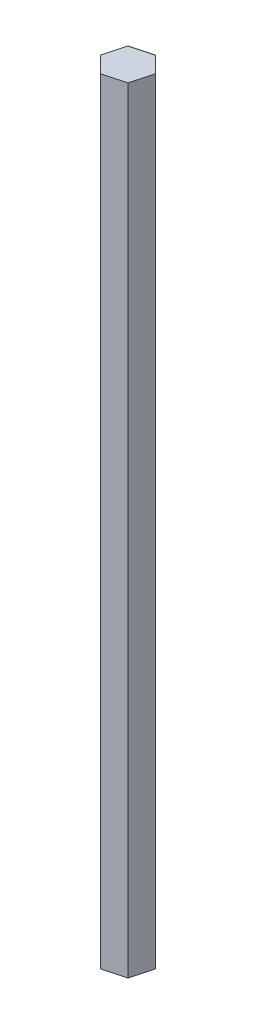
ISO-10303-21;
HEADER;
FILE_DESCRIPTION(('STEP AP214'),'2;1');
FILE_NAME('part.step','',(''),(''),'','','');
FILE_SCHEMA(('AUTOMOTIVE_DESIGN { 1 0 10303 214 1 1 1 1 }'));
ENDSEC;
DATA;
#1=APPLICATION_CONTEXT('core data for automotive mechanical design processes');
#2=APPLICATION_PROTOCOL_DEFINITION('international standard','automotive_design',2000,#1);
#3=PRODUCT_CONTEXT('',#1,'mechanical');
#4=PRODUCT('Part','Part','',(#3));
#5=PRODUCT_RELATED_PRODUCT_CATEGORY('part','',(#4));
#6=PRODUCT_DEFINITION_FORMATION('','',#4);
#7=PRODUCT_DEFINITION_CONTEXT('part definition',#1,'design');
#8=PRODUCT_DEFINITION('design','',#6,#7);
#9=PRODUCT_DEFINITION_SHAPE('','',#8);
#10=(LENGTH_UNIT() NAMED_UNIT(*) SI_UNIT(.MILLI.,.METRE.));
#11=(NAMED_UNIT(*) PLANE_ANGLE_UNIT() SI_UNIT($,.RADIAN.));
#12=(NAMED_UNIT(*) SI_UNIT($,.STERADIAN.) SOLID_ANGLE_UNIT());
#13=UNCERTAINTY_MEASURE_WITH_UNIT(LENGTH_MEASURE(1.E-05),#10,'distance_accuracy_value','');
#14=(GEOMETRIC_REPRESENTATION_CONTEXT(3) GLOBAL_UNCERTAINTY_ASSIGNED_CONTEXT((#13)) GLOBAL_UNIT_ASSIGNED_CONTEXT((#10,
#11,#12)) REPRESENTATION_CONTEXT('',''));
#15=CARTESIAN_POINT('',(0.,0.,0.));
#16=DIRECTION('',(0.,0.,1.));
#17=DIRECTION('',(1.,0.,0.));
#18=AXIS2_PLACEMENT_3D('',#15,#16,#17);
#19=CARTESIAN_POINT('',(-1.90646108622519,252.476,7.11500963644527));
#20=DIRECTION('',(-0.258819045102518,0.,-0.965925826289069));
#21=DIRECTION('',(-0.965925826289069,0.,0.258819045102518));
#22=AXIS2_PLACEMENT_3D('',#19,#20,#21);
#23=PLANE('',#22);
#24=DIRECTION('',(0.965925826289069,0.,-0.258819045102518));
#25=VECTOR('',#24,1.);
#26=CARTESIAN_POINT('',(-1.90646108622519,0.,7.11500963644527));
#27=LINE('',#26,#25);
#28=CARTESIAN_POINT('',(-1.90646108622519,0.,7.11500963644527));
#29=VERTEX_POINT('',#28);
#30=CARTESIAN_POINT('',(5.20854855022009,0.,5.20854855022012));
#31=VERTEX_POINT('',#30);
#32=EDGE_CURVE('E128',#29,#31,#27,.T.);
#33=ORIENTED_EDGE('',*,*,#32,.T.);
#34=DIRECTION('',(0.,-1.,0.));
#35=VECTOR('',#34,1.);
#36=CARTESIAN_POINT('',(5.20854855022009,252.476,5.20854855022012));
#37=LINE('',#36,#35);
#38=CARTESIAN_POINT('',(5.20854855022009,252.476,5.20854855022012));
#39=VERTEX_POINT('',#38);
#40=EDGE_CURVE('E11',#39,#31,#37,.T.);
#41=ORIENTED_EDGE('',*,*,#40,.F.);
#42=DIRECTION('',(0.965925826289069,0.,-0.258819045102518));
#43=VECTOR('',#42,1.);
#44=CARTESIAN_POINT('',(-1.90646108622519,252.476,7.11500963644527));
#45=LINE('',#44,#43);
#46=CARTESIAN_POINT('',(-1.90646108622519,252.476,7.11500963644527));
#47=VERTEX_POINT('',#46);
#48=EDGE_CURVE('E144',#47,#39,#45,.T.);
#49=ORIENTED_EDGE('',*,*,#48,.F.);
#50=DIRECTION('',(0.,-1.,0.));
#51=VECTOR('',#50,1.);
#52=CARTESIAN_POINT('',(-1.90646108622519,252.476,7.11500963644527));
#53=LINE('',#52,#51);
#54=EDGE_CURVE('E124',#47,#29,#53,.T.);
#55=ORIENTED_EDGE('',*,*,#54,.T.);
#56=EDGE_LOOP('',(#33,#41,#49,#55));
#57=FACE_BOUND('',#56,.T.);
#58=ADVANCED_FACE('F39',(#57),#23,.F.);
#59=CARTESIAN_POINT('',(5.20854855022009,252.476,5.20854855022012));
#60=DIRECTION('',(-0.965925826289068,0.,-0.258819045102524));
#61=DIRECTION('',(-0.258819045102524,0.,0.965925826289068));
#62=AXIS2_PLACEMENT_3D('',#59,#60,#61);
#63=PLANE('',#62);
#64=DIRECTION('',(0.258819045102524,0.,-0.965925826289068));
#65=VECTOR('',#64,1.);
#66=CARTESIAN_POINT('',(5.20854855022009,0.,5.20854855022012));
#67=LINE('',#66,#65);
#68=CARTESIAN_POINT('',(7.11500963644528,0.,-1.90646108622515));
#69=VERTEX_POINT('',#68);
#70=EDGE_CURVE('E132',#31,#69,#67,.T.);
#71=ORIENTED_EDGE('',*,*,#70,.T.);
#72=DIRECTION('',(0.,-1.,0.));
#73=VECTOR('',#72,1.);
#74=CARTESIAN_POINT('',(7.11500963644528,252.476,-1.90646108622515));
#75=LINE('',#74,#73);
#76=CARTESIAN_POINT('',(7.11500963644528,252.476,-1.90646108622515));
#77=VERTEX_POINT('',#76);
#78=EDGE_CURVE('E48',#77,#69,#75,.T.);
#79=ORIENTED_EDGE('',*,*,#78,.F.);
#80=DIRECTION('',(0.258819045102524,0.,-0.965925826289068));
#81=VECTOR('',#80,1.);
#82=CARTESIAN_POINT('',(5.20854855022009,252.476,5.20854855022012));
#83=LINE('',#82,#81);
#84=EDGE_CURVE('E93',#39,#77,#83,.T.);
#85=ORIENTED_EDGE('',*,*,#84,.F.);
#86=ORIENTED_EDGE('',*,*,#40,.T.);
#87=EDGE_LOOP('',(#71,#79,#85,#86));
#88=FACE_BOUND('',#87,.T.);
#89=ADVANCED_FACE('F172',(#88),#63,.F.);
#90=CARTESIAN_POINT('',(7.11500963644528,252.476,-1.90646108622515));
#91=DIRECTION('',(-0.70710678118655,0.,0.707106781186545));
#92=DIRECTION('',(0.707106781186545,0.,0.70710678118655));
#93=AXIS2_PLACEMENT_3D('',#90,#91,#92);
#94=PLANE('',#93);
#95=DIRECTION('',(-0.707106781186546,0.,-0.70710678118655));
#96=VECTOR('',#95,1.);
#97=CARTESIAN_POINT('',(7.11500963644528,0.,-1.90646108622515));
#98=LINE('',#97,#96);
#99=CARTESIAN_POINT('',(1.90646108622519,0.,-7.11500963644527));
#100=VERTEX_POINT('',#99);
#101=EDGE_CURVE('E135',#69,#100,#98,.T.);
#102=ORIENTED_EDGE('',*,*,#101,.T.);
#103=DIRECTION('',(0.,-1.,0.));
#104=VECTOR('',#103,1.);
#105=CARTESIAN_POINT('',(1.90646108622519,252.476,-7.11500963644527));
#106=LINE('',#105,#104);
#107=CARTESIAN_POINT('',(1.90646108622519,252.476,-7.11500963644527));
#108=VERTEX_POINT('',#107);
#109=EDGE_CURVE('E117',#108,#100,#106,.T.);
#110=ORIENTED_EDGE('',*,*,#109,.F.);
#111=DIRECTION('',(-0.707106781186546,0.,-0.70710678118655));
#112=VECTOR('',#111,1.);
#113=CARTESIAN_POINT('',(7.11500963644528,252.476,-1.90646108622515));
#114=LINE('',#113,#112);
#115=EDGE_CURVE('E106',#77,#108,#114,.T.);
#116=ORIENTED_EDGE('',*,*,#115,.F.);
#117=ORIENTED_EDGE('',*,*,#78,.T.);
#118=EDGE_LOOP('',(#102,#110,#116,#117));
#119=FACE_BOUND('',#118,.T.);
#120=ADVANCED_FACE('F154',(#119),#94,.F.);
#121=CARTESIAN_POINT('',(1.90646108622519,252.476,-7.11500963644527));
#122=DIRECTION('',(0.258819045102518,0.,0.965925826289069));
#123=DIRECTION('',(0.965925826289069,0.,-0.258819045102518));
#124=AXIS2_PLACEMENT_3D('',#121,#122,#123);
#125=PLANE('',#124);
#126=DIRECTION('',(-0.965925826289069,0.,0.258819045102518));
#127=VECTOR('',#126,1.);
#128=CARTESIAN_POINT('',(1.90646108622519,0.,-7.11500963644527));
#129=LINE('',#128,#127);
#130=CARTESIAN_POINT('',(-5.20854855022009,0.,-5.20854855022012));
#131=VERTEX_POINT('',#130);
#132=EDGE_CURVE('E115',#100,#131,#129,.T.);
#133=ORIENTED_EDGE('',*,*,#132,.T.);
#134=DIRECTION('',(0.,-1.,0.));
#135=VECTOR('',#134,1.);
#136=CARTESIAN_POINT('',(-5.20854855022009,252.476,-5.20854855022012));
#137=LINE('',#136,#135);
#138=CARTESIAN_POINT('',(-5.20854855022009,252.476,-5.20854855022012));
#139=VERTEX_POINT('',#138);
#140=EDGE_CURVE('E112',#139,#131,#137,.T.);
#141=ORIENTED_EDGE('',*,*,#140,.F.);
#142=DIRECTION('',(-0.965925826289069,0.,0.258819045102518));
#143=VECTOR('',#142,1.);
#144=CARTESIAN_POINT('',(1.90646108622519,252.476,-7.11500963644527));
#145=LINE('',#144,#143);
#146=EDGE_CURVE('E100',#108,#139,#145,.T.);
#147=ORIENTED_EDGE('',*,*,#146,.F.);
#148=ORIENTED_EDGE('',*,*,#109,.T.);
#149=EDGE_LOOP('',(#133,#141,#147,#148));
#150=FACE_BOUND('',#149,.T.);
#151=ADVANCED_FACE('F113',(#150),#125,.F.);
#152=CARTESIAN_POINT('',(-5.20854855022009,252.476,-5.20854855022012));
#153=DIRECTION('',(0.965925826289068,0.,0.258819045102524));
#154=DIRECTION('',(0.258819045102524,0.,-0.965925826289068));
#155=AXIS2_PLACEMENT_3D('',#152,#153,#154);
#156=PLANE('',#155);
#157=DIRECTION('',(-0.258819045102524,0.,0.965925826289068));
#158=VECTOR('',#157,1.);
#159=CARTESIAN_POINT('',(-5.20854855022009,0.,-5.20854855022012));
#160=LINE('',#159,#158);
#161=CARTESIAN_POINT('',(-7.11500963644528,0.,1.90646108622515));
#162=VERTEX_POINT('',#161);
#163=EDGE_CURVE('E79',#131,#162,#160,.T.);
#164=ORIENTED_EDGE('',*,*,#163,.T.);
#165=DIRECTION('',(0.,-1.,0.));
#166=VECTOR('',#165,1.);
#167=CARTESIAN_POINT('',(-7.11500963644528,252.476,1.90646108622515));
#168=LINE('',#167,#166);
#169=CARTESIAN_POINT('',(-7.11500963644528,252.476,1.90646108622515));
#170=VERTEX_POINT('',#169);
#171=EDGE_CURVE('E118',#170,#162,#168,.T.);
#172=ORIENTED_EDGE('',*,*,#171,.F.);
#173=DIRECTION('',(-0.258819045102524,0.,0.965925826289068));
#174=VECTOR('',#173,1.);
#175=CARTESIAN_POINT('',(-5.20854855022009,252.476,-5.20854855022012));
#176=LINE('',#175,#174);
#177=EDGE_CURVE('E104',#139,#170,#176,.T.);
#178=ORIENTED_EDGE('',*,*,#177,.F.);
#179=ORIENTED_EDGE('',*,*,#140,.T.);
#180=EDGE_LOOP('',(#164,#172,#178,#179));
#181=FACE_BOUND('',#180,.T.);
#182=ADVANCED_FACE('F120',(#181),#156,.F.);
#183=CARTESIAN_POINT('',(-7.11500963644528,252.476,1.90646108622515));
#184=DIRECTION('',(0.707106781186549,0.,-0.707106781186545));
#185=DIRECTION('',(-0.707106781186546,0.,-0.70710678118655));
#186=AXIS2_PLACEMENT_3D('',#183,#184,#185);
#187=PLANE('',#186);
#188=DIRECTION('',(0.707106781186546,0.,0.70710678118655));
#189=VECTOR('',#188,1.);
#190=CARTESIAN_POINT('',(-7.11500963644528,0.,1.90646108622515));
#191=LINE('',#190,#189);
#192=EDGE_CURVE('E85',#162,#29,#191,.T.);
#193=ORIENTED_EDGE('',*,*,#192,.T.);
#194=ORIENTED_EDGE('',*,*,#54,.F.);
#195=DIRECTION('',(0.707106781186546,0.,0.70710678118655));
#196=VECTOR('',#195,1.);
#197=CARTESIAN_POINT('',(-7.11500963644528,252.476,1.90646108622515));
#198=LINE('',#197,#196);
#199=EDGE_CURVE('E56',#170,#47,#198,.T.);
#200=ORIENTED_EDGE('',*,*,#199,.F.);
#201=ORIENTED_EDGE('',*,*,#171,.T.);
#202=EDGE_LOOP('',(#193,#194,#200,#201));
#203=FACE_BOUND('',#202,.T.);
#204=ADVANCED_FACE('F161',(#203),#187,.F.);
#205=CARTESIAN_POINT('',(0.,252.476,0.));
#206=DIRECTION('',(0.,1.,0.));
#207=DIRECTION('',(0.,0.,1.));
#208=AXIS2_PLACEMENT_3D('',#205,#206,#207);
#209=PLANE('',#208);
#210=ORIENTED_EDGE('',*,*,#48,.T.);
#211=ORIENTED_EDGE('',*,*,#84,.T.);
#212=ORIENTED_EDGE('',*,*,#115,.T.);
#213=ORIENTED_EDGE('',*,*,#146,.T.);
#214=ORIENTED_EDGE('',*,*,#177,.T.);
#215=ORIENTED_EDGE('',*,*,#199,.T.);
#216=EDGE_LOOP('',(#210,#211,#212,#213,#214,#215));
#217=FACE_BOUND('',#216,.T.);
#218=ADVANCED_FACE('F102',(#217),#209,.T.);
#219=CARTESIAN_POINT('',(0.,0.,0.));
#220=DIRECTION('',(0.,1.,0.));
#221=DIRECTION('',(0.,0.,1.));
#222=AXIS2_PLACEMENT_3D('',#219,#220,#221);
#223=PLANE('',#222);
#224=ORIENTED_EDGE('',*,*,#32,.F.);
#225=ORIENTED_EDGE('',*,*,#192,.F.);
#226=ORIENTED_EDGE('',*,*,#163,.F.);
#227=ORIENTED_EDGE('',*,*,#132,.F.);
#228=ORIENTED_EDGE('',*,*,#101,.F.);
#229=ORIENTED_EDGE('',*,*,#70,.F.);
#230=EDGE_LOOP('',(#224,#225,#226,#227,#228,#229));
#231=FACE_BOUND('',#230,.T.);
#232=ADVANCED_FACE('F157',(#231),#223,.F.);
#233=CLOSED_SHELL('',(#58,#89,#120,#151,#182,#204,#218,#232));
#234=MANIFOLD_SOLID_BREP('B2',#233);
#235=ADVANCED_BREP_SHAPE_REPRESENTATION('',(#18,#234),#14);
#236=SHAPE_DEFINITION_REPRESENTATION(#9,#235);
ENDSEC;
END-ISO-10303-21;
